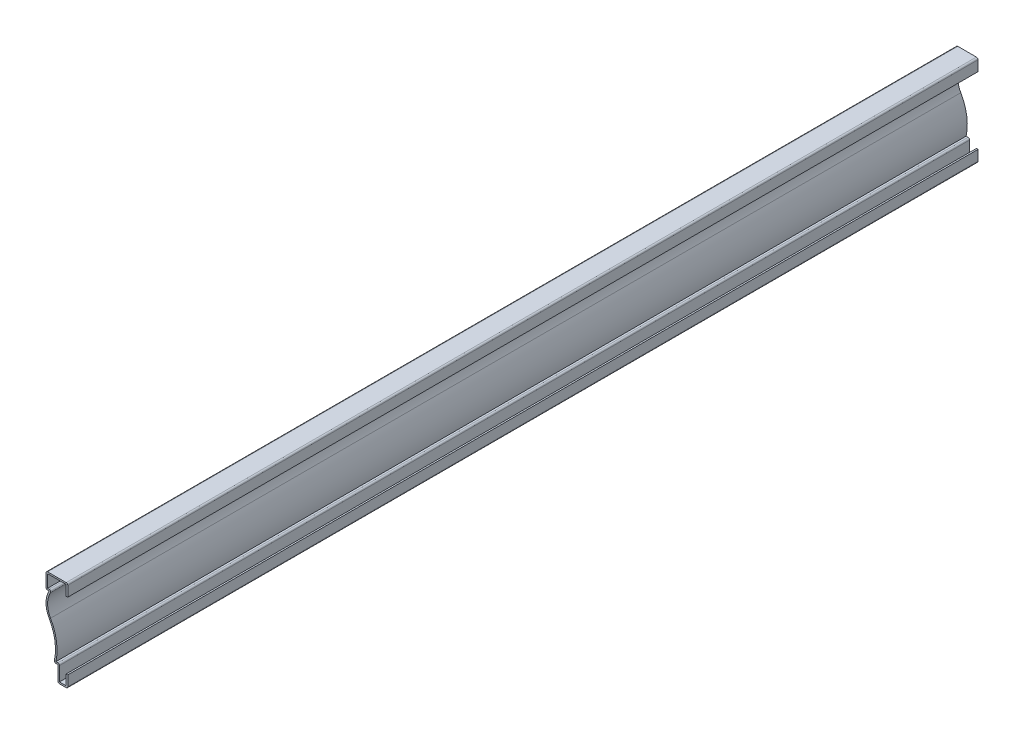
ISO-10303-21;
HEADER;
FILE_DESCRIPTION(('STEP AP214'),'2;1');
FILE_NAME('part.step','',(''),(''),'','','');
FILE_SCHEMA(('AUTOMOTIVE_DESIGN { 1 0 10303 214 1 1 1 1 }'));
ENDSEC;
DATA;
#1=APPLICATION_CONTEXT('core data for automotive mechanical design processes');
#2=APPLICATION_PROTOCOL_DEFINITION('international standard','automotive_design',2000,#1);
#3=PRODUCT_CONTEXT('',#1,'mechanical');
#4=PRODUCT('Part','Part','',(#3));
#5=PRODUCT_RELATED_PRODUCT_CATEGORY('part','',(#4));
#6=PRODUCT_DEFINITION_FORMATION('','',#4);
#7=PRODUCT_DEFINITION_CONTEXT('part definition',#1,'design');
#8=PRODUCT_DEFINITION('design','',#6,#7);
#9=PRODUCT_DEFINITION_SHAPE('','',#8);
#10=(LENGTH_UNIT() NAMED_UNIT(*) SI_UNIT(.MILLI.,.METRE.));
#11=(NAMED_UNIT(*) PLANE_ANGLE_UNIT() SI_UNIT($,.RADIAN.));
#12=(NAMED_UNIT(*) SI_UNIT($,.STERADIAN.) SOLID_ANGLE_UNIT());
#13=UNCERTAINTY_MEASURE_WITH_UNIT(LENGTH_MEASURE(1.E-05),#10,'distance_accuracy_value','');
#14=(GEOMETRIC_REPRESENTATION_CONTEXT(3) GLOBAL_UNCERTAINTY_ASSIGNED_CONTEXT((#13)) GLOBAL_UNIT_ASSIGNED_CONTEXT((#10,
#11,#12)) REPRESENTATION_CONTEXT('',''));
#15=CARTESIAN_POINT('',(0.,0.,0.));
#16=DIRECTION('',(0.,0.,1.));
#17=DIRECTION('',(1.,0.,0.));
#18=AXIS2_PLACEMENT_3D('',#15,#16,#17);
#19=CARTESIAN_POINT('',(-1.27,73.025,-730.25));
#20=DIRECTION('',(-1.,0.,0.));
#21=DIRECTION('',(0.,-1.,0.));
#22=AXIS2_PLACEMENT_3D('',#19,#20,#21);
#23=PLANE('',#22);
#24=DIRECTION('',(0.,-1.,0.));
#25=VECTOR('',#24,1.);
#26=CARTESIAN_POINT('',(-1.27,73.025,0.));
#27=LINE('',#26,#25);
#28=CARTESIAN_POINT('',(-1.27,71.755,0.));
#29=VERTEX_POINT('',#28);
#30=CARTESIAN_POINT('',(-1.27,63.5,0.));
#31=VERTEX_POINT('',#30);
#32=EDGE_CURVE('E312',#29,#31,#27,.T.);
#33=ORIENTED_EDGE('',*,*,#32,.F.);
#34=DIRECTION('',(0.,0.,1.));
#35=VECTOR('',#34,1.);
#36=CARTESIAN_POINT('',(-1.27,71.755,-730.25));
#37=LINE('',#36,#35);
#38=CARTESIAN_POINT('',(-1.27,71.755,-730.25));
#39=VERTEX_POINT('',#38);
#40=EDGE_CURVE('E257',#39,#29,#37,.T.);
#41=ORIENTED_EDGE('',*,*,#40,.F.);
#42=DIRECTION('',(0.,-1.,0.));
#43=VECTOR('',#42,1.);
#44=CARTESIAN_POINT('',(-1.27,73.025,-730.25));
#45=LINE('',#44,#43);
#46=CARTESIAN_POINT('',(-1.27,63.5,-730.25));
#47=VERTEX_POINT('',#46);
#48=EDGE_CURVE('E239',#39,#47,#45,.T.);
#49=ORIENTED_EDGE('',*,*,#48,.T.);
#50=DIRECTION('',(0.,0.,1.));
#51=VECTOR('',#50,1.);
#52=CARTESIAN_POINT('',(-1.27,63.5,-730.25));
#53=LINE('',#52,#51);
#54=EDGE_CURVE('E247',#47,#31,#53,.T.);
#55=ORIENTED_EDGE('',*,*,#54,.T.);
#56=EDGE_LOOP('',(#33,#41,#49,#55));
#57=FACE_BOUND('',#56,.T.);
#58=ADVANCED_FACE('F35',(#57),#23,.T.);
#59=CARTESIAN_POINT('',(-17.4625,71.755,-730.25));
#60=DIRECTION('',(0.,-1.,0.));
#61=DIRECTION('',(1.,0.,0.));
#62=AXIS2_PLACEMENT_3D('',#59,#60,#61);
#63=PLANE('',#62);
#64=DIRECTION('',(1.,0.,0.));
#65=VECTOR('',#64,1.);
#66=CARTESIAN_POINT('',(-17.4625,71.755,0.));
#67=LINE('',#66,#65);
#68=CARTESIAN_POINT('',(-16.1925,71.755,0.));
#69=VERTEX_POINT('',#68);
#70=EDGE_CURVE('E258',#69,#29,#67,.T.);
#71=ORIENTED_EDGE('',*,*,#70,.F.);
#72=DIRECTION('',(0.,0.,1.));
#73=VECTOR('',#72,1.);
#74=CARTESIAN_POINT('',(-16.1925,71.755,-730.25));
#75=LINE('',#74,#73);
#76=CARTESIAN_POINT('',(-16.1925,71.755,-730.25));
#77=VERTEX_POINT('',#76);
#78=EDGE_CURVE('E365',#77,#69,#75,.T.);
#79=ORIENTED_EDGE('',*,*,#78,.F.);
#80=DIRECTION('',(1.,0.,0.));
#81=VECTOR('',#80,1.);
#82=CARTESIAN_POINT('',(-17.4625,71.755,-730.25));
#83=LINE('',#82,#81);
#84=EDGE_CURVE('E255',#77,#39,#83,.T.);
#85=ORIENTED_EDGE('',*,*,#84,.T.);
#86=ORIENTED_EDGE('',*,*,#40,.T.);
#87=EDGE_LOOP('',(#71,#79,#85,#86));
#88=FACE_BOUND('',#87,.T.);
#89=ADVANCED_FACE('F473',(#88),#63,.T.);
#90=CARTESIAN_POINT('',(-16.1925,60.325,-730.25));
#91=DIRECTION('',(1.,0.,0.));
#92=DIRECTION('',(0.,0.,-1.));
#93=AXIS2_PLACEMENT_3D('',#90,#91,#92);
#94=PLANE('',#93);
#95=DIRECTION('',(0.,1.,0.));
#96=VECTOR('',#95,1.);
#97=CARTESIAN_POINT('',(-16.1925,60.325,0.));
#98=LINE('',#97,#96);
#99=CARTESIAN_POINT('',(-16.1925,61.595,0.));
#100=VERTEX_POINT('',#99);
#101=EDGE_CURVE('E261',#100,#69,#98,.T.);
#102=ORIENTED_EDGE('',*,*,#101,.F.);
#103=DIRECTION('',(0.,0.,1.));
#104=VECTOR('',#103,1.);
#105=CARTESIAN_POINT('',(-16.1925,61.595,-730.25));
#106=LINE('',#105,#104);
#107=CARTESIAN_POINT('',(-16.1925,61.595,-730.25));
#108=VERTEX_POINT('',#107);
#109=EDGE_CURVE('E367',#108,#100,#106,.T.);
#110=ORIENTED_EDGE('',*,*,#109,.F.);
#111=DIRECTION('',(0.,1.,0.));
#112=VECTOR('',#111,1.);
#113=CARTESIAN_POINT('',(-16.1925,60.325,-730.25));
#114=LINE('',#113,#112);
#115=EDGE_CURVE('E308',#108,#77,#114,.T.);
#116=ORIENTED_EDGE('',*,*,#115,.T.);
#117=ORIENTED_EDGE('',*,*,#78,.T.);
#118=EDGE_LOOP('',(#102,#110,#116,#117));
#119=FACE_BOUND('',#118,.T.);
#120=ADVANCED_FACE('F479',(#119),#94,.T.);
#121=CARTESIAN_POINT('',(-14.9304230288237,61.595,-730.25));
#122=DIRECTION('',(0.,1.,0.));
#123=DIRECTION('',(-1.,0.,0.));
#124=AXIS2_PLACEMENT_3D('',#121,#122,#123);
#125=PLANE('',#124);
#126=DIRECTION('',(-1.,0.,0.));
#127=VECTOR('',#126,1.);
#128=CARTESIAN_POINT('',(-14.9304230288237,61.595,0.));
#129=LINE('',#128,#127);
#130=CARTESIAN_POINT('',(-14.9304230288237,61.595,0.));
#131=VERTEX_POINT('',#130);
#132=EDGE_CURVE('E359',#131,#100,#129,.T.);
#133=ORIENTED_EDGE('',*,*,#132,.F.);
#134=DIRECTION('',(0.,0.,1.));
#135=VECTOR('',#134,1.);
#136=CARTESIAN_POINT('',(-14.9304230288237,61.595,-730.25));
#137=LINE('',#136,#135);
#138=CARTESIAN_POINT('',(-14.9304230288237,61.595,-730.25));
#139=VERTEX_POINT('',#138);
#140=EDGE_CURVE('E454',#131,#139,#137,.F.);
#141=ORIENTED_EDGE('',*,*,#140,.T.);
#142=DIRECTION('',(-1.,0.,0.));
#143=VECTOR('',#142,1.);
#144=CARTESIAN_POINT('',(-14.9304230288237,61.595,-730.25));
#145=LINE('',#144,#143);
#146=EDGE_CURVE('E306',#139,#108,#145,.T.);
#147=ORIENTED_EDGE('',*,*,#146,.T.);
#148=ORIENTED_EDGE('',*,*,#109,.T.);
#149=EDGE_LOOP('',(#133,#141,#147,#148));
#150=FACE_BOUND('',#149,.T.);
#151=ADVANCED_FACE('F482',(#150),#125,.T.);
#152=CARTESIAN_POINT('',(1.5875,50.8349673965863,-730.25));
#153=DIRECTION('',(0.,0.,1.));
#154=DIRECTION('',(1.,0.,0.));
#155=AXIS2_PLACEMENT_3D('',#152,#153,#154);
#156=CYLINDRICAL_SURFACE('',#155,17.78);
#157=CARTESIAN_POINT('',(1.5875,50.8349673965863,-730.25));
#158=DIRECTION('',(0.,0.,1.));
#159=DIRECTION('',(1.,0.,0.));
#160=AXIS2_PLACEMENT_3D('',#157,#158,#159);
#161=CIRCLE('',#160,17.78);
#162=CARTESIAN_POINT('',(-13.8292281602355,41.9776036334002,-730.25));
#163=VERTEX_POINT('',#162);
#164=CARTESIAN_POINT('',(-13.8292281602355,59.6923311597724,-730.25));
#165=VERTEX_POINT('',#164);
#166=EDGE_CURVE('E303',#163,#165,#161,.F.);
#167=ORIENTED_EDGE('',*,*,#166,.T.);
#168=DIRECTION('',(0.,0.,1.));
#169=VECTOR('',#168,1.);
#170=CARTESIAN_POINT('',(-13.8292281602355,59.6923311597724,-730.25));
#171=LINE('',#170,#169);
#172=CARTESIAN_POINT('',(-13.8292281602355,59.6923311597724,0.));
#173=VERTEX_POINT('',#172);
#174=EDGE_CURVE('E451',#165,#173,#171,.T.);
#175=ORIENTED_EDGE('',*,*,#174,.T.);
#176=CARTESIAN_POINT('',(1.5875,50.8349673965863,0.));
#177=DIRECTION('',(0.,0.,1.));
#178=DIRECTION('',(1.,0.,0.));
#179=AXIS2_PLACEMENT_3D('',#176,#177,#178);
#180=CIRCLE('',#179,17.78);
#181=CARTESIAN_POINT('',(-13.8292281602355,41.9776036334002,0.));
#182=VERTEX_POINT('',#181);
#183=EDGE_CURVE('E356',#182,#173,#180,.F.);
#184=ORIENTED_EDGE('',*,*,#183,.F.);
#185=DIRECTION('',(0.,0.,1.));
#186=VECTOR('',#185,1.);
#187=CARTESIAN_POINT('',(-13.8292281602355,41.9776036334002,-730.25));
#188=LINE('',#187,#186);
#189=EDGE_CURVE('E370',#163,#182,#188,.T.);
#190=ORIENTED_EDGE('',*,*,#189,.F.);
#191=EDGE_LOOP('',(#167,#175,#184,#190));
#192=FACE_BOUND('',#191,.T.);
#193=ADVANCED_FACE('F490',(#192),#156,.F.);
#194=CARTESIAN_POINT('',(-47.9662690864712,22.3648695863452,-730.25));
#195=DIRECTION('',(0.,0.,1.));
#196=DIRECTION('',(1.,0.,0.));
#197=AXIS2_PLACEMENT_3D('',#194,#195,#196);
#198=CYLINDRICAL_SURFACE('',#197,39.37);
#199=CARTESIAN_POINT('',(-47.9662690864712,22.3648695863452,0.));
#200=DIRECTION('',(0.,0.,1.));
#201=DIRECTION('',(1.,0.,0.));
#202=AXIS2_PLACEMENT_3D('',#199,#200,#201);
#203=CIRCLE('',#202,39.37);
#204=CARTESIAN_POINT('',(-9.50170013492493,13.97,0.));
#205=VERTEX_POINT('',#204);
#206=EDGE_CURVE('E353',#205,#182,#203,.T.);
#207=ORIENTED_EDGE('',*,*,#206,.F.);
#208=DIRECTION('',(0.,0.,1.));
#209=VECTOR('',#208,1.);
#210=CARTESIAN_POINT('',(-9.50170013492493,13.97,-730.25));
#211=LINE('',#210,#209);
#212=CARTESIAN_POINT('',(-9.50170013492493,13.97,-730.25));
#213=VERTEX_POINT('',#212);
#214=EDGE_CURVE('E372',#213,#205,#211,.T.);
#215=ORIENTED_EDGE('',*,*,#214,.F.);
#216=CARTESIAN_POINT('',(-47.9662690864712,22.3648695863452,-730.25));
#217=DIRECTION('',(0.,0.,1.));
#218=DIRECTION('',(1.,0.,0.));
#219=AXIS2_PLACEMENT_3D('',#216,#217,#218);
#220=CIRCLE('',#219,39.37);
#221=EDGE_CURVE('E300',#213,#163,#220,.T.);
#222=ORIENTED_EDGE('',*,*,#221,.T.);
#223=ORIENTED_EDGE('',*,*,#189,.T.);
#224=EDGE_LOOP('',(#207,#215,#222,#223));
#225=FACE_BOUND('',#224,.T.);
#226=ADVANCED_FACE('F494',(#225),#198,.T.);
#227=CARTESIAN_POINT('',(-7.9375,13.97,-730.25));
#228=DIRECTION('',(0.,1.,0.));
#229=DIRECTION('',(-1.,0.,0.));
#230=AXIS2_PLACEMENT_3D('',#227,#228,#229);
#231=PLANE('',#230);
#232=DIRECTION('',(-1.,0.,0.));
#233=VECTOR('',#232,1.);
#234=CARTESIAN_POINT('',(-7.9375,13.97,0.));
#235=LINE('',#234,#233);
#236=CARTESIAN_POINT('',(-7.9375,13.97,0.));
#237=VERTEX_POINT('',#236);
#238=EDGE_CURVE('E351',#237,#205,#235,.T.);
#239=ORIENTED_EDGE('',*,*,#238,.F.);
#240=DIRECTION('',(0.,0.,1.));
#241=VECTOR('',#240,1.);
#242=CARTESIAN_POINT('',(-7.9375,13.97,-730.25));
#243=LINE('',#242,#241);
#244=CARTESIAN_POINT('',(-7.9375,13.97,-730.25));
#245=VERTEX_POINT('',#244);
#246=EDGE_CURVE('E447',#237,#245,#243,.F.);
#247=ORIENTED_EDGE('',*,*,#246,.T.);
#248=DIRECTION('',(-1.,0.,0.));
#249=VECTOR('',#248,1.);
#250=CARTESIAN_POINT('',(-7.9375,13.97,-730.25));
#251=LINE('',#250,#249);
#252=EDGE_CURVE('E298',#245,#213,#251,.T.);
#253=ORIENTED_EDGE('',*,*,#252,.T.);
#254=ORIENTED_EDGE('',*,*,#214,.T.);
#255=EDGE_LOOP('',(#239,#247,#253,#254));
#256=FACE_BOUND('',#255,.T.);
#257=ADVANCED_FACE('F763',(#256),#231,.T.);
#258=CARTESIAN_POINT('',(-6.6675,0.,-730.25));
#259=DIRECTION('',(1.,0.,0.));
#260=DIRECTION('',(0.,0.,-1.));
#261=AXIS2_PLACEMENT_3D('',#258,#259,#260);
#262=PLANE('',#261);
#263=DIRECTION('',(0.,1.,0.));
#264=VECTOR('',#263,1.);
#265=CARTESIAN_POINT('',(-6.6675,0.,-730.25));
#266=LINE('',#265,#264);
#267=CARTESIAN_POINT('',(-6.6675,1.27,-730.25));
#268=VERTEX_POINT('',#267);
#269=CARTESIAN_POINT('',(-6.6675,12.7,-730.25));
#270=VERTEX_POINT('',#269);
#271=EDGE_CURVE('E295',#268,#270,#266,.T.);
#272=ORIENTED_EDGE('',*,*,#271,.T.);
#273=DIRECTION('',(0.,0.,1.));
#274=VECTOR('',#273,1.);
#275=CARTESIAN_POINT('',(-6.6675,12.7,-730.25));
#276=LINE('',#275,#274);
#277=CARTESIAN_POINT('',(-6.6675,12.7,0.));
#278=VERTEX_POINT('',#277);
#279=EDGE_CURVE('E444',#270,#278,#276,.T.);
#280=ORIENTED_EDGE('',*,*,#279,.T.);
#281=DIRECTION('',(0.,1.,0.));
#282=VECTOR('',#281,1.);
#283=CARTESIAN_POINT('',(-6.6675,0.,0.));
#284=LINE('',#283,#282);
#285=CARTESIAN_POINT('',(-6.6675,1.27,0.));
#286=VERTEX_POINT('',#285);
#287=EDGE_CURVE('E348',#286,#278,#284,.T.);
#288=ORIENTED_EDGE('',*,*,#287,.F.);
#289=DIRECTION('',(0.,0.,1.));
#290=VECTOR('',#289,1.);
#291=CARTESIAN_POINT('',(-6.6675,1.27,-730.25));
#292=LINE('',#291,#290);
#293=EDGE_CURVE('E375',#268,#286,#292,.T.);
#294=ORIENTED_EDGE('',*,*,#293,.F.);
#295=EDGE_LOOP('',(#272,#280,#288,#294));
#296=FACE_BOUND('',#295,.T.);
#297=ADVANCED_FACE('F506',(#296),#262,.T.);
#298=CARTESIAN_POINT('',(0.,1.27,-730.25));
#299=DIRECTION('',(0.,1.,0.));
#300=DIRECTION('',(-1.,0.,0.));
#301=AXIS2_PLACEMENT_3D('',#298,#299,#300);
#302=PLANE('',#301);
#303=DIRECTION('',(-1.,0.,0.));
#304=VECTOR('',#303,1.);
#305=CARTESIAN_POINT('',(0.,1.27,0.));
#306=LINE('',#305,#304);
#307=CARTESIAN_POINT('',(-1.27,1.27,0.));
#308=VERTEX_POINT('',#307);
#309=EDGE_CURVE('E345',#308,#286,#306,.T.);
#310=ORIENTED_EDGE('',*,*,#309,.F.);
#311=DIRECTION('',(0.,0.,1.));
#312=VECTOR('',#311,1.);
#313=CARTESIAN_POINT('',(-1.27,1.27,-730.25));
#314=LINE('',#313,#312);
#315=CARTESIAN_POINT('',(-1.27,1.27,-730.25));
#316=VERTEX_POINT('',#315);
#317=EDGE_CURVE('E377',#316,#308,#314,.T.);
#318=ORIENTED_EDGE('',*,*,#317,.F.);
#319=DIRECTION('',(-1.,0.,0.));
#320=VECTOR('',#319,1.);
#321=CARTESIAN_POINT('',(0.,1.27,-730.25));
#322=LINE('',#321,#320);
#323=EDGE_CURVE('E292',#316,#268,#322,.T.);
#324=ORIENTED_EDGE('',*,*,#323,.T.);
#325=ORIENTED_EDGE('',*,*,#293,.T.);
#326=EDGE_LOOP('',(#310,#318,#324,#325));
#327=FACE_BOUND('',#326,.T.);
#328=ADVANCED_FACE('F512',(#327),#302,.T.);
#329=CARTESIAN_POINT('',(-1.27,9.525,-730.25));
#330=DIRECTION('',(-1.,0.,0.));
#331=DIRECTION('',(0.,-1.,0.));
#332=AXIS2_PLACEMENT_3D('',#329,#330,#331);
#333=PLANE('',#332);
#334=DIRECTION('',(0.,-1.,0.));
#335=VECTOR('',#334,1.);
#336=CARTESIAN_POINT('',(-1.27,9.525,0.));
#337=LINE('',#336,#335);
#338=CARTESIAN_POINT('',(-1.27,9.525,0.));
#339=VERTEX_POINT('',#338);
#340=EDGE_CURVE('E342',#339,#308,#337,.T.);
#341=ORIENTED_EDGE('',*,*,#340,.F.);
#342=DIRECTION('',(0.,0.,1.));
#343=VECTOR('',#342,1.);
#344=CARTESIAN_POINT('',(-1.27,9.525,-730.25));
#345=LINE('',#344,#343);
#346=CARTESIAN_POINT('',(-1.27,9.525,-730.25));
#347=VERTEX_POINT('',#346);
#348=EDGE_CURVE('E379',#347,#339,#345,.T.);
#349=ORIENTED_EDGE('',*,*,#348,.F.);
#350=DIRECTION('',(0.,-1.,0.));
#351=VECTOR('',#350,1.);
#352=CARTESIAN_POINT('',(-1.27,9.525,-730.25));
#353=LINE('',#352,#351);
#354=EDGE_CURVE('E289',#347,#316,#353,.T.);
#355=ORIENTED_EDGE('',*,*,#354,.T.);
#356=ORIENTED_EDGE('',*,*,#317,.T.);
#357=EDGE_LOOP('',(#341,#349,#355,#356));
#358=FACE_BOUND('',#357,.T.);
#359=ADVANCED_FACE('F516',(#358),#333,.T.);
#360=CARTESIAN_POINT('',(-1.27,9.525,-730.25));
#361=DIRECTION('',(0.,-1.,0.));
#362=DIRECTION('',(0.,0.,-1.));
#363=AXIS2_PLACEMENT_3D('',#360,#361,#362);
#364=PLANE('',#363);
#365=DIRECTION('',(1.,0.,0.));
#366=VECTOR('',#365,1.);
#367=CARTESIAN_POINT('',(-1.27,9.525,0.));
#368=LINE('',#367,#366);
#369=CARTESIAN_POINT('',(0.,9.525,0.));
#370=VERTEX_POINT('',#369);
#371=EDGE_CURVE('E340',#339,#370,#368,.T.);
#372=ORIENTED_EDGE('',*,*,#371,.T.);
#373=DIRECTION('',(0.,0.,1.));
#374=VECTOR('',#373,1.);
#375=CARTESIAN_POINT('',(0.,9.525,-730.25));
#376=LINE('',#375,#374);
#377=CARTESIAN_POINT('',(0.,9.525,-730.25));
#378=VERTEX_POINT('',#377);
#379=EDGE_CURVE('E381',#378,#370,#376,.T.);
#380=ORIENTED_EDGE('',*,*,#379,.F.);
#381=DIRECTION('',(1.,0.,0.));
#382=VECTOR('',#381,1.);
#383=CARTESIAN_POINT('',(-1.27,9.525,-730.25));
#384=LINE('',#383,#382);
#385=EDGE_CURVE('E287',#347,#378,#384,.T.);
#386=ORIENTED_EDGE('',*,*,#385,.F.);
#387=ORIENTED_EDGE('',*,*,#348,.T.);
#388=EDGE_LOOP('',(#372,#380,#386,#387));
#389=FACE_BOUND('',#388,.T.);
#390=ADVANCED_FACE('F520',(#389),#364,.F.);
#391=CARTESIAN_POINT('',(0.,9.525,-730.25));
#392=DIRECTION('',(-1.,0.,0.));
#393=DIRECTION('',(0.,-1.,0.));
#394=AXIS2_PLACEMENT_3D('',#391,#392,#393);
#395=PLANE('',#394);
#396=DIRECTION('',(0.,-1.,0.));
#397=VECTOR('',#396,1.);
#398=CARTESIAN_POINT('',(0.,9.525,0.));
#399=LINE('',#398,#397);
#400=CARTESIAN_POINT('',(0.,1.27,0.));
#401=VERTEX_POINT('',#400);
#402=EDGE_CURVE('E337',#370,#401,#399,.T.);
#403=ORIENTED_EDGE('',*,*,#402,.T.);
#404=DIRECTION('',(0.,0.,1.));
#405=VECTOR('',#404,1.);
#406=CARTESIAN_POINT('',(0.,1.27,-730.25));
#407=LINE('',#406,#405);
#408=CARTESIAN_POINT('',(0.,1.27,-730.25));
#409=VERTEX_POINT('',#408);
#410=EDGE_CURVE('E449',#401,#409,#407,.F.);
#411=ORIENTED_EDGE('',*,*,#410,.T.);
#412=DIRECTION('',(0.,-1.,0.));
#413=VECTOR('',#412,1.);
#414=CARTESIAN_POINT('',(0.,9.525,-730.25));
#415=LINE('',#414,#413);
#416=EDGE_CURVE('E284',#378,#409,#415,.T.);
#417=ORIENTED_EDGE('',*,*,#416,.F.);
#418=ORIENTED_EDGE('',*,*,#379,.T.);
#419=EDGE_LOOP('',(#403,#411,#417,#418));
#420=FACE_BOUND('',#419,.T.);
#421=ADVANCED_FACE('F727',(#420),#395,.F.);
#422=CARTESIAN_POINT('',(0.,0.,-730.25));
#423=DIRECTION('',(0.,1.,0.));
#424=DIRECTION('',(-1.,0.,0.));
#425=AXIS2_PLACEMENT_3D('',#422,#423,#424);
#426=PLANE('',#425);
#427=DIRECTION('',(-1.,0.,0.));
#428=VECTOR('',#427,1.);
#429=CARTESIAN_POINT('',(0.,0.,0.));
#430=LINE('',#429,#428);
#431=CARTESIAN_POINT('',(-1.27,0.,0.));
#432=VERTEX_POINT('',#431);
#433=CARTESIAN_POINT('',(-6.6675,0.,0.));
#434=VERTEX_POINT('',#433);
#435=EDGE_CURVE('E334',#432,#434,#430,.T.);
#436=ORIENTED_EDGE('',*,*,#435,.T.);
#437=DIRECTION('',(0.,0.,1.));
#438=VECTOR('',#437,1.);
#439=CARTESIAN_POINT('',(-6.6675,0.,-730.25));
#440=LINE('',#439,#438);
#441=CARTESIAN_POINT('',(-6.6675,0.,-730.25));
#442=VERTEX_POINT('',#441);
#443=EDGE_CURVE('E442',#434,#442,#440,.F.);
#444=ORIENTED_EDGE('',*,*,#443,.T.);
#445=DIRECTION('',(-1.,0.,0.));
#446=VECTOR('',#445,1.);
#447=CARTESIAN_POINT('',(0.,0.,-730.25));
#448=LINE('',#447,#446);
#449=CARTESIAN_POINT('',(-1.27,0.,-730.25));
#450=VERTEX_POINT('',#449);
#451=EDGE_CURVE('E281',#450,#442,#448,.T.);
#452=ORIENTED_EDGE('',*,*,#451,.F.);
#453=DIRECTION('',(0.,0.,1.));
#454=VECTOR('',#453,1.);
#455=CARTESIAN_POINT('',(-1.27,0.,-730.25));
#456=LINE('',#455,#454);
#457=EDGE_CURVE('E439',#450,#432,#456,.T.);
#458=ORIENTED_EDGE('',*,*,#457,.T.);
#459=EDGE_LOOP('',(#436,#444,#452,#458));
#460=FACE_BOUND('',#459,.T.);
#461=ADVANCED_FACE('F531',(#460),#426,.F.);
#462=CARTESIAN_POINT('',(-7.9375,0.,-730.25));
#463=DIRECTION('',(1.,0.,0.));
#464=DIRECTION('',(0.,0.,-1.));
#465=AXIS2_PLACEMENT_3D('',#462,#463,#464);
#466=PLANE('',#465);
#467=DIRECTION('',(0.,1.,0.));
#468=VECTOR('',#467,1.);
#469=CARTESIAN_POINT('',(-7.9375,0.,-730.25));
#470=LINE('',#469,#468);
#471=CARTESIAN_POINT('',(-7.9375,1.27,-730.25));
#472=VERTEX_POINT('',#471);
#473=CARTESIAN_POINT('',(-7.9375,12.7,-730.25));
#474=VERTEX_POINT('',#473);
#475=EDGE_CURVE('E279',#472,#474,#470,.T.);
#476=ORIENTED_EDGE('',*,*,#475,.F.);
#477=DIRECTION('',(0.,0.,1.));
#478=VECTOR('',#477,1.);
#479=CARTESIAN_POINT('',(-7.9375,1.27,-730.25));
#480=LINE('',#479,#478);
#481=CARTESIAN_POINT('',(-7.9375,1.27,0.));
#482=VERTEX_POINT('',#481);
#483=EDGE_CURVE('E436',#472,#482,#480,.T.);
#484=ORIENTED_EDGE('',*,*,#483,.T.);
#485=DIRECTION('',(0.,1.,0.));
#486=VECTOR('',#485,1.);
#487=CARTESIAN_POINT('',(-7.9375,0.,0.));
#488=LINE('',#487,#486);
#489=CARTESIAN_POINT('',(-7.9375,12.7,0.));
#490=VERTEX_POINT('',#489);
#491=EDGE_CURVE('E332',#482,#490,#488,.T.);
#492=ORIENTED_EDGE('',*,*,#491,.T.);
#493=DIRECTION('',(0.,0.,1.));
#494=VECTOR('',#493,1.);
#495=CARTESIAN_POINT('',(-7.9375,12.7,-730.25));
#496=LINE('',#495,#494);
#497=EDGE_CURVE('E384',#474,#490,#496,.T.);
#498=ORIENTED_EDGE('',*,*,#497,.F.);
#499=EDGE_LOOP('',(#476,#484,#492,#498));
#500=FACE_BOUND('',#499,.T.);
#501=ADVANCED_FACE('F542',(#500),#466,.F.);
#502=CARTESIAN_POINT('',(-7.9375,12.7,-730.25));
#503=DIRECTION('',(0.,1.,0.));
#504=DIRECTION('',(-1.,0.,0.));
#505=AXIS2_PLACEMENT_3D('',#502,#503,#504);
#506=PLANE('',#505);
#507=DIRECTION('',(-1.,0.,0.));
#508=VECTOR('',#507,1.);
#509=CARTESIAN_POINT('',(-7.9375,12.7,0.));
#510=LINE('',#509,#508);
#511=CARTESIAN_POINT('',(-9.50170013492493,12.7,0.));
#512=VERTEX_POINT('',#511);
#513=EDGE_CURVE('E329',#490,#512,#510,.T.);
#514=ORIENTED_EDGE('',*,*,#513,.T.);
#515=DIRECTION('',(0.,0.,1.));
#516=VECTOR('',#515,1.);
#517=CARTESIAN_POINT('',(-9.50170013492493,12.7,-730.25));
#518=LINE('',#517,#516);
#519=CARTESIAN_POINT('',(-9.50170013492493,12.7,-730.25));
#520=VERTEX_POINT('',#519);
#521=EDGE_CURVE('E434',#512,#520,#518,.F.);
#522=ORIENTED_EDGE('',*,*,#521,.T.);
#523=DIRECTION('',(-1.,0.,0.));
#524=VECTOR('',#523,1.);
#525=CARTESIAN_POINT('',(-7.9375,12.7,-730.25));
#526=LINE('',#525,#524);
#527=EDGE_CURVE('E276',#474,#520,#526,.T.);
#528=ORIENTED_EDGE('',*,*,#527,.F.);
#529=ORIENTED_EDGE('',*,*,#497,.T.);
#530=EDGE_LOOP('',(#514,#522,#528,#529));
#531=FACE_BOUND('',#530,.T.);
#532=ADVANCED_FACE('F705',(#531),#506,.F.);
#533=CARTESIAN_POINT('',(-47.9662690864712,22.3648695863452,-730.25));
#534=DIRECTION('',(0.,0.,1.));
#535=DIRECTION('',(1.,0.,0.));
#536=AXIS2_PLACEMENT_3D('',#533,#534,#535);
#537=CYLINDRICAL_SURFACE('',#536,38.1);
#538=CARTESIAN_POINT('',(-47.9662690864712,22.3648695863452,-730.25));
#539=DIRECTION('',(0.,0.,1.));
#540=DIRECTION('',(1.,0.,0.));
#541=AXIS2_PLACEMENT_3D('',#538,#539,#540);
#542=CIRCLE('',#541,38.1);
#543=CARTESIAN_POINT('',(-10.742492681749,14.2408022447208,-730.25));
#544=VERTEX_POINT('',#543);
#545=CARTESIAN_POINT('',(-14.9304230288237,41.3449347931726,-730.25));
#546=VERTEX_POINT('',#545);
#547=EDGE_CURVE('E274',#544,#546,#542,.T.);
#548=ORIENTED_EDGE('',*,*,#547,.F.);
#549=DIRECTION('',(0.,0.,1.));
#550=VECTOR('',#549,1.);
#551=CARTESIAN_POINT('',(-10.742492681749,14.2408022447208,-730.25));
#552=LINE('',#551,#550);
#553=CARTESIAN_POINT('',(-10.742492681749,14.2408022447208,0.));
#554=VERTEX_POINT('',#553);
#555=EDGE_CURVE('E431',#544,#554,#552,.T.);
#556=ORIENTED_EDGE('',*,*,#555,.T.);
#557=CARTESIAN_POINT('',(-47.9662690864712,22.3648695863452,0.));
#558=DIRECTION('',(0.,0.,1.));
#559=DIRECTION('',(1.,0.,0.));
#560=AXIS2_PLACEMENT_3D('',#557,#558,#559);
#561=CIRCLE('',#560,38.1);
#562=CARTESIAN_POINT('',(-14.9304230288237,41.3449347931726,0.));
#563=VERTEX_POINT('',#562);
#564=EDGE_CURVE('E327',#554,#563,#561,.T.);
#565=ORIENTED_EDGE('',*,*,#564,.T.);
#566=DIRECTION('',(0.,0.,1.));
#567=VECTOR('',#566,1.);
#568=CARTESIAN_POINT('',(-14.9304230288237,41.3449347931726,-730.25));
#569=LINE('',#568,#567);
#570=EDGE_CURVE('E387',#546,#563,#569,.T.);
#571=ORIENTED_EDGE('',*,*,#570,.F.);
#572=EDGE_LOOP('',(#548,#556,#565,#571));
#573=FACE_BOUND('',#572,.T.);
#574=ADVANCED_FACE('F554',(#573),#537,.F.);
#575=CARTESIAN_POINT('',(1.5875,50.8349673965863,-730.25));
#576=DIRECTION('',(0.,0.,1.));
#577=DIRECTION('',(1.,0.,0.));
#578=AXIS2_PLACEMENT_3D('',#575,#576,#577);
#579=CYLINDRICAL_SURFACE('',#578,19.05);
#580=CARTESIAN_POINT('',(1.5875,50.8349673965863,0.));
#581=DIRECTION('',(0.,0.,-1.));
#582=DIRECTION('',(-1.,0.,0.));
#583=AXIS2_PLACEMENT_3D('',#580,#581,#582);
#584=CIRCLE('',#583,19.05);
#585=CARTESIAN_POINT('',(-14.9304230288237,60.325,0.));
#586=VERTEX_POINT('',#585);
#587=EDGE_CURVE('E325',#563,#586,#584,.T.);
#588=ORIENTED_EDGE('',*,*,#587,.T.);
#589=DIRECTION('',(0.,0.,1.));
#590=VECTOR('',#589,1.);
#591=CARTESIAN_POINT('',(-14.9304230288237,60.325,-730.25));
#592=LINE('',#591,#590);
#593=CARTESIAN_POINT('',(-14.9304230288237,60.325,-730.25));
#594=VERTEX_POINT('',#593);
#595=EDGE_CURVE('E390',#594,#586,#592,.T.);
#596=ORIENTED_EDGE('',*,*,#595,.F.);
#597=CARTESIAN_POINT('',(1.5875,50.8349673965863,-730.25));
#598=DIRECTION('',(0.,0.,-1.));
#599=DIRECTION('',(-1.,0.,0.));
#600=AXIS2_PLACEMENT_3D('',#597,#598,#599);
#601=CIRCLE('',#600,19.05);
#602=EDGE_CURVE('E272',#546,#594,#601,.T.);
#603=ORIENTED_EDGE('',*,*,#602,.F.);
#604=ORIENTED_EDGE('',*,*,#570,.T.);
#605=EDGE_LOOP('',(#588,#596,#603,#604));
#606=FACE_BOUND('',#605,.T.);
#607=ADVANCED_FACE('F560',(#606),#579,.T.);
#608=CARTESIAN_POINT('',(-14.9304230288237,60.325,-730.25));
#609=DIRECTION('',(0.,1.,0.));
#610=DIRECTION('',(-1.,0.,0.));
#611=AXIS2_PLACEMENT_3D('',#608,#609,#610);
#612=PLANE('',#611);
#613=DIRECTION('',(-1.,0.,0.));
#614=VECTOR('',#613,1.);
#615=CARTESIAN_POINT('',(-14.9304230288237,60.325,0.));
#616=LINE('',#615,#614);
#617=CARTESIAN_POINT('',(-16.1925,60.325,0.));
#618=VERTEX_POINT('',#617);
#619=EDGE_CURVE('E322',#586,#618,#616,.T.);
#620=ORIENTED_EDGE('',*,*,#619,.T.);
#621=DIRECTION('',(0.,0.,1.));
#622=VECTOR('',#621,1.);
#623=CARTESIAN_POINT('',(-16.1925,60.325,-730.25));
#624=LINE('',#623,#622);
#625=CARTESIAN_POINT('',(-16.1925,60.325,-730.25));
#626=VERTEX_POINT('',#625);
#627=EDGE_CURVE('E414',#618,#626,#624,.F.);
#628=ORIENTED_EDGE('',*,*,#627,.T.);
#629=DIRECTION('',(-1.,0.,0.));
#630=VECTOR('',#629,1.);
#631=CARTESIAN_POINT('',(-14.9304230288237,60.325,-730.25));
#632=LINE('',#631,#630);
#633=EDGE_CURVE('E270',#594,#626,#632,.T.);
#634=ORIENTED_EDGE('',*,*,#633,.F.);
#635=ORIENTED_EDGE('',*,*,#595,.T.);
#636=EDGE_LOOP('',(#620,#628,#634,#635));
#637=FACE_BOUND('',#636,.T.);
#638=ADVANCED_FACE('F564',(#637),#612,.F.);
#639=CARTESIAN_POINT('',(-17.4625,60.325,-730.25));
#640=DIRECTION('',(1.,0.,0.));
#641=DIRECTION('',(0.,0.,-1.));
#642=AXIS2_PLACEMENT_3D('',#639,#640,#641);
#643=PLANE('',#642);
#644=DIRECTION('',(0.,1.,0.));
#645=VECTOR('',#644,1.);
#646=CARTESIAN_POINT('',(-17.4625,60.325,-730.25));
#647=LINE('',#646,#645);
#648=CARTESIAN_POINT('',(-17.4625,61.595,-730.25));
#649=VERTEX_POINT('',#648);
#650=CARTESIAN_POINT('',(-17.4625,71.755,-730.25));
#651=VERTEX_POINT('',#650);
#652=EDGE_CURVE('E267',#649,#651,#647,.T.);
#653=ORIENTED_EDGE('',*,*,#652,.F.);
#654=DIRECTION('',(0.,0.,1.));
#655=VECTOR('',#654,1.);
#656=CARTESIAN_POINT('',(-17.4625,61.595,-730.25));
#657=LINE('',#656,#655);
#658=CARTESIAN_POINT('',(-17.4625,61.595,0.));
#659=VERTEX_POINT('',#658);
#660=EDGE_CURVE('E395',#649,#659,#657,.T.);
#661=ORIENTED_EDGE('',*,*,#660,.T.);
#662=DIRECTION('',(0.,1.,0.));
#663=VECTOR('',#662,1.);
#664=CARTESIAN_POINT('',(-17.4625,60.325,0.));
#665=LINE('',#664,#663);
#666=CARTESIAN_POINT('',(-17.4625,71.755,0.));
#667=VERTEX_POINT('',#666);
#668=EDGE_CURVE('E319',#659,#667,#665,.T.);
#669=ORIENTED_EDGE('',*,*,#668,.T.);
#670=DIRECTION('',(0.,0.,1.));
#671=VECTOR('',#670,1.);
#672=CARTESIAN_POINT('',(-17.4625,71.755,-730.25));
#673=LINE('',#672,#671);
#674=EDGE_CURVE('E364',#667,#651,#673,.F.);
#675=ORIENTED_EDGE('',*,*,#674,.T.);
#676=EDGE_LOOP('',(#653,#661,#669,#675));
#677=FACE_BOUND('',#676,.T.);
#678=ADVANCED_FACE('F572',(#677),#643,.F.);
#679=CARTESIAN_POINT('',(-17.4625,73.025,-730.25));
#680=DIRECTION('',(0.,-1.,0.));
#681=DIRECTION('',(1.,0.,0.));
#682=AXIS2_PLACEMENT_3D('',#679,#680,#681);
#683=PLANE('',#682);
#684=DIRECTION('',(1.,0.,0.));
#685=VECTOR('',#684,1.);
#686=CARTESIAN_POINT('',(-17.4625,73.025,-730.25));
#687=LINE('',#686,#685);
#688=CARTESIAN_POINT('',(-16.1925,73.025,-730.25));
#689=VERTEX_POINT('',#688);
#690=CARTESIAN_POINT('',(-1.27,73.025,-730.25));
#691=VERTEX_POINT('',#690);
#692=EDGE_CURVE('E265',#689,#691,#687,.T.);
#693=ORIENTED_EDGE('',*,*,#692,.F.);
#694=DIRECTION('',(0.,0.,1.));
#695=VECTOR('',#694,1.);
#696=CARTESIAN_POINT('',(-16.1925,73.025,-730.25));
#697=LINE('',#696,#695);
#698=CARTESIAN_POINT('',(-16.1925,73.025,0.));
#699=VERTEX_POINT('',#698);
#700=EDGE_CURVE('E43',#689,#699,#697,.T.);
#701=ORIENTED_EDGE('',*,*,#700,.T.);
#702=DIRECTION('',(1.,0.,0.));
#703=VECTOR('',#702,1.);
#704=CARTESIAN_POINT('',(-17.4625,73.025,0.));
#705=LINE('',#704,#703);
#706=CARTESIAN_POINT('',(-1.27,73.025,0.));
#707=VERTEX_POINT('',#706);
#708=EDGE_CURVE('E317',#699,#707,#705,.T.);
#709=ORIENTED_EDGE('',*,*,#708,.T.);
#710=DIRECTION('',(0.,0.,1.));
#711=VECTOR('',#710,1.);
#712=CARTESIAN_POINT('',(-1.27,73.025,-730.25));
#713=LINE('',#712,#711);
#714=EDGE_CURVE('E58',#707,#691,#713,.F.);
#715=ORIENTED_EDGE('',*,*,#714,.T.);
#716=EDGE_LOOP('',(#693,#701,#709,#715));
#717=FACE_BOUND('',#716,.T.);
#718=ADVANCED_FACE('F459',(#717),#683,.F.);
#719=CARTESIAN_POINT('',(0.,73.025,-730.25));
#720=DIRECTION('',(-1.,0.,0.));
#721=DIRECTION('',(0.,-1.,0.));
#722=AXIS2_PLACEMENT_3D('',#719,#720,#721);
#723=PLANE('',#722);
#724=DIRECTION('',(0.,-1.,0.));
#725=VECTOR('',#724,1.);
#726=CARTESIAN_POINT('',(0.,73.025,-730.25));
#727=LINE('',#726,#725);
#728=CARTESIAN_POINT('',(0.,71.755,-730.25));
#729=VERTEX_POINT('',#728);
#730=CARTESIAN_POINT('',(0.,63.5,-730.25));
#731=VERTEX_POINT('',#730);
#732=EDGE_CURVE('E241',#729,#731,#727,.T.);
#733=ORIENTED_EDGE('',*,*,#732,.F.);
#734=DIRECTION('',(0.,0.,1.));
#735=VECTOR('',#734,1.);
#736=CARTESIAN_POINT('',(0.,71.755,-730.25));
#737=LINE('',#736,#735);
#738=CARTESIAN_POINT('',(0.,71.755,0.));
#739=VERTEX_POINT('',#738);
#740=EDGE_CURVE('E11',#729,#739,#737,.T.);
#741=ORIENTED_EDGE('',*,*,#740,.T.);
#742=DIRECTION('',(0.,-1.,0.));
#743=VECTOR('',#742,1.);
#744=CARTESIAN_POINT('',(0.,73.025,0.));
#745=LINE('',#744,#743);
#746=CARTESIAN_POINT('',(0.,63.5,0.));
#747=VERTEX_POINT('',#746);
#748=EDGE_CURVE('E315',#739,#747,#745,.T.);
#749=ORIENTED_EDGE('',*,*,#748,.T.);
#750=DIRECTION('',(0.,0.,1.));
#751=VECTOR('',#750,1.);
#752=CARTESIAN_POINT('',(0.,63.5,-730.25));
#753=LINE('',#752,#751);
#754=EDGE_CURVE('E254',#731,#747,#753,.T.);
#755=ORIENTED_EDGE('',*,*,#754,.F.);
#756=EDGE_LOOP('',(#733,#741,#749,#755));
#757=FACE_BOUND('',#756,.T.);
#758=ADVANCED_FACE('F469',(#757),#723,.F.);
#759=CARTESIAN_POINT('',(0.,63.5,-730.25));
#760=DIRECTION('',(0.,1.,0.));
#761=DIRECTION('',(0.,0.,1.));
#762=AXIS2_PLACEMENT_3D('',#759,#760,#761);
#763=PLANE('',#762);
#764=DIRECTION('',(-1.,0.,0.));
#765=VECTOR('',#764,1.);
#766=CARTESIAN_POINT('',(0.,63.5,0.));
#767=LINE('',#766,#765);
#768=EDGE_CURVE('E250',#747,#31,#767,.T.);
#769=ORIENTED_EDGE('',*,*,#768,.T.);
#770=ORIENTED_EDGE('',*,*,#54,.F.);
#771=DIRECTION('',(-1.,0.,0.));
#772=VECTOR('',#771,1.);
#773=CARTESIAN_POINT('',(0.,63.5,-730.25));
#774=LINE('',#773,#772);
#775=EDGE_CURVE('E233',#731,#47,#774,.T.);
#776=ORIENTED_EDGE('',*,*,#775,.F.);
#777=ORIENTED_EDGE('',*,*,#754,.T.);
#778=EDGE_LOOP('',(#769,#770,#776,#777));
#779=FACE_BOUND('',#778,.T.);
#780=ADVANCED_FACE('F248',(#779),#763,.F.);
#781=CARTESIAN_POINT('',(1.5875,50.8349673965863,-730.25));
#782=DIRECTION('',(0.,0.,-1.));
#783=DIRECTION('',(-1.,0.,0.));
#784=AXIS2_PLACEMENT_3D('',#781,#782,#783);
#785=PLANE('',#784);
#786=ORIENTED_EDGE('',*,*,#633,.T.);
#787=CARTESIAN_POINT('',(-16.1925,61.595,-730.25));
#788=DIRECTION('',(0.,0.,-1.));
#789=DIRECTION('',(-1.,0.,0.));
#790=AXIS2_PLACEMENT_3D('',#787,#788,#789);
#791=CIRCLE('',#790,1.27);
#792=EDGE_CURVE('E429',#626,#649,#791,.T.);
#793=ORIENTED_EDGE('',*,*,#792,.T.);
#794=ORIENTED_EDGE('',*,*,#652,.T.);
#795=CARTESIAN_POINT('',(-16.1925,71.755,-730.25));
#796=DIRECTION('',(0.,0.,-1.));
#797=DIRECTION('',(-1.,0.,0.));
#798=AXIS2_PLACEMENT_3D('',#795,#796,#797);
#799=CIRCLE('',#798,1.27);
#800=EDGE_CURVE('E417',#651,#689,#799,.T.);
#801=ORIENTED_EDGE('',*,*,#800,.T.);
#802=ORIENTED_EDGE('',*,*,#692,.T.);
#803=CARTESIAN_POINT('',(-1.27,71.755,-730.25));
#804=DIRECTION('',(0.,0.,-1.));
#805=DIRECTION('',(-1.,0.,0.));
#806=AXIS2_PLACEMENT_3D('',#803,#804,#805);
#807=CIRCLE('',#806,1.27);
#808=EDGE_CURVE('E50',#691,#729,#807,.T.);
#809=ORIENTED_EDGE('',*,*,#808,.T.);
#810=ORIENTED_EDGE('',*,*,#732,.T.);
#811=ORIENTED_EDGE('',*,*,#775,.T.);
#812=ORIENTED_EDGE('',*,*,#48,.F.);
#813=ORIENTED_EDGE('',*,*,#84,.F.);
#814=ORIENTED_EDGE('',*,*,#115,.F.);
#815=ORIENTED_EDGE('',*,*,#146,.F.);
#816=CARTESIAN_POINT('',(-14.9304230288237,60.325,-730.25));
#817=DIRECTION('',(0.,0.,-1.));
#818=DIRECTION('',(-1.,0.,0.));
#819=AXIS2_PLACEMENT_3D('',#816,#817,#818);
#820=CIRCLE('',#819,1.27);
#821=EDGE_CURVE('E419',#139,#165,#820,.T.);
#822=ORIENTED_EDGE('',*,*,#821,.T.);
#823=ORIENTED_EDGE('',*,*,#166,.F.);
#824=ORIENTED_EDGE('',*,*,#221,.F.);
#825=ORIENTED_EDGE('',*,*,#252,.F.);
#826=CARTESIAN_POINT('',(-7.9375,12.7,-730.25));
#827=DIRECTION('',(0.,0.,-1.));
#828=DIRECTION('',(-1.,0.,0.));
#829=AXIS2_PLACEMENT_3D('',#826,#827,#828);
#830=CIRCLE('',#829,1.27);
#831=EDGE_CURVE('E423',#245,#270,#830,.T.);
#832=ORIENTED_EDGE('',*,*,#831,.T.);
#833=ORIENTED_EDGE('',*,*,#271,.F.);
#834=ORIENTED_EDGE('',*,*,#323,.F.);
#835=ORIENTED_EDGE('',*,*,#354,.F.);
#836=ORIENTED_EDGE('',*,*,#385,.T.);
#837=ORIENTED_EDGE('',*,*,#416,.T.);
#838=CARTESIAN_POINT('',(-1.27,1.27,-730.25));
#839=DIRECTION('',(0.,0.,-1.));
#840=DIRECTION('',(-1.,0.,0.));
#841=AXIS2_PLACEMENT_3D('',#838,#839,#840);
#842=CIRCLE('',#841,1.27);
#843=EDGE_CURVE('E421',#409,#450,#842,.T.);
#844=ORIENTED_EDGE('',*,*,#843,.T.);
#845=ORIENTED_EDGE('',*,*,#451,.T.);
#846=CARTESIAN_POINT('',(-6.6675,1.27,-730.25));
#847=DIRECTION('',(0.,0.,-1.));
#848=DIRECTION('',(-1.,0.,0.));
#849=AXIS2_PLACEMENT_3D('',#846,#847,#848);
#850=CIRCLE('',#849,1.27);
#851=EDGE_CURVE('E425',#442,#472,#850,.T.);
#852=ORIENTED_EDGE('',*,*,#851,.T.);
#853=ORIENTED_EDGE('',*,*,#475,.T.);
#854=ORIENTED_EDGE('',*,*,#527,.T.);
#855=CARTESIAN_POINT('',(-9.50170013492493,13.97,-730.25));
#856=DIRECTION('',(0.,0.,-1.));
#857=DIRECTION('',(-1.,0.,0.));
#858=AXIS2_PLACEMENT_3D('',#855,#856,#857);
#859=CIRCLE('',#858,1.27);
#860=EDGE_CURVE('E427',#520,#544,#859,.T.);
#861=ORIENTED_EDGE('',*,*,#860,.T.);
#862=ORIENTED_EDGE('',*,*,#547,.T.);
#863=ORIENTED_EDGE('',*,*,#602,.T.);
#864=EDGE_LOOP('',(#786,#793,#794,#801,#802,#809,#810,#811,#812,#813,#814,#815,#822,#823,#824,
#825,#832,#833,#834,#835,#836,#837,#844,#845,#852,#853,#854,#861,#862,#863));
#865=FACE_BOUND('',#864,.T.);
#866=ADVANCED_FACE('F236',(#865),#785,.T.);
#867=CARTESIAN_POINT('',(1.5875,50.8349673965863,0.));
#868=DIRECTION('',(0.,0.,-1.));
#869=DIRECTION('',(-1.,0.,0.));
#870=AXIS2_PLACEMENT_3D('',#867,#868,#869);
#871=PLANE('',#870);
#872=ORIENTED_EDGE('',*,*,#668,.F.);
#873=CARTESIAN_POINT('',(-16.1925,61.595,0.));
#874=DIRECTION('',(0.,0.,-1.));
#875=DIRECTION('',(-1.,0.,0.));
#876=AXIS2_PLACEMENT_3D('',#873,#874,#875);
#877=CIRCLE('',#876,1.27);
#878=EDGE_CURVE('E412',#659,#618,#877,.F.);
#879=ORIENTED_EDGE('',*,*,#878,.T.);
#880=ORIENTED_EDGE('',*,*,#619,.F.);
#881=ORIENTED_EDGE('',*,*,#587,.F.);
#882=ORIENTED_EDGE('',*,*,#564,.F.);
#883=CARTESIAN_POINT('',(-9.50170013492493,13.97,0.));
#884=DIRECTION('',(0.,0.,-1.));
#885=DIRECTION('',(-1.,0.,0.));
#886=AXIS2_PLACEMENT_3D('',#883,#884,#885);
#887=CIRCLE('',#886,1.27);
#888=EDGE_CURVE('E410',#554,#512,#887,.F.);
#889=ORIENTED_EDGE('',*,*,#888,.T.);
#890=ORIENTED_EDGE('',*,*,#513,.F.);
#891=ORIENTED_EDGE('',*,*,#491,.F.);
#892=CARTESIAN_POINT('',(-6.6675,1.27,0.));
#893=DIRECTION('',(0.,0.,-1.));
#894=DIRECTION('',(-1.,0.,0.));
#895=AXIS2_PLACEMENT_3D('',#892,#893,#894);
#896=CIRCLE('',#895,1.27);
#897=EDGE_CURVE('E408',#482,#434,#896,.F.);
#898=ORIENTED_EDGE('',*,*,#897,.T.);
#899=ORIENTED_EDGE('',*,*,#435,.F.);
#900=CARTESIAN_POINT('',(-1.27,1.27,0.));
#901=DIRECTION('',(0.,0.,-1.));
#902=DIRECTION('',(-1.,0.,0.));
#903=AXIS2_PLACEMENT_3D('',#900,#901,#902);
#904=CIRCLE('',#903,1.27);
#905=EDGE_CURVE('E404',#432,#401,#904,.F.);
#906=ORIENTED_EDGE('',*,*,#905,.T.);
#907=ORIENTED_EDGE('',*,*,#402,.F.);
#908=ORIENTED_EDGE('',*,*,#371,.F.);
#909=ORIENTED_EDGE('',*,*,#340,.T.);
#910=ORIENTED_EDGE('',*,*,#309,.T.);
#911=ORIENTED_EDGE('',*,*,#287,.T.);
#912=CARTESIAN_POINT('',(-7.9375,12.7,0.));
#913=DIRECTION('',(0.,0.,-1.));
#914=DIRECTION('',(-1.,0.,0.));
#915=AXIS2_PLACEMENT_3D('',#912,#913,#914);
#916=CIRCLE('',#915,1.27);
#917=EDGE_CURVE('E406',#278,#237,#916,.F.);
#918=ORIENTED_EDGE('',*,*,#917,.T.);
#919=ORIENTED_EDGE('',*,*,#238,.T.);
#920=ORIENTED_EDGE('',*,*,#206,.T.);
#921=ORIENTED_EDGE('',*,*,#183,.T.);
#922=CARTESIAN_POINT('',(-14.9304230288237,60.325,0.));
#923=DIRECTION('',(0.,0.,-1.));
#924=DIRECTION('',(-1.,0.,0.));
#925=AXIS2_PLACEMENT_3D('',#922,#923,#924);
#926=CIRCLE('',#925,1.27);
#927=EDGE_CURVE('E402',#173,#131,#926,.F.);
#928=ORIENTED_EDGE('',*,*,#927,.T.);
#929=ORIENTED_EDGE('',*,*,#132,.T.);
#930=ORIENTED_EDGE('',*,*,#101,.T.);
#931=ORIENTED_EDGE('',*,*,#70,.T.);
#932=ORIENTED_EDGE('',*,*,#32,.T.);
#933=ORIENTED_EDGE('',*,*,#768,.F.);
#934=ORIENTED_EDGE('',*,*,#748,.F.);
#935=CARTESIAN_POINT('',(-1.27,71.755,0.));
#936=DIRECTION('',(0.,0.,-1.));
#937=DIRECTION('',(-1.,0.,0.));
#938=AXIS2_PLACEMENT_3D('',#935,#936,#937);
#939=CIRCLE('',#938,1.27);
#940=EDGE_CURVE('E398',#739,#707,#939,.F.);
#941=ORIENTED_EDGE('',*,*,#940,.T.);
#942=ORIENTED_EDGE('',*,*,#708,.F.);
#943=CARTESIAN_POINT('',(-16.1925,71.755,0.));
#944=DIRECTION('',(0.,0.,-1.));
#945=DIRECTION('',(-1.,0.,0.));
#946=AXIS2_PLACEMENT_3D('',#943,#944,#945);
#947=CIRCLE('',#946,1.27);
#948=EDGE_CURVE('E400',#699,#667,#947,.F.);
#949=ORIENTED_EDGE('',*,*,#948,.T.);
#950=EDGE_LOOP('',(#872,#879,#880,#881,#882,#889,#890,#891,#898,#899,#906,#907,#908,#909,#910,
#911,#918,#919,#920,#921,#928,#929,#930,#931,#932,#933,#934,#941,#942,#949));
#951=FACE_BOUND('',#950,.T.);
#952=ADVANCED_FACE('F464',(#951),#871,.F.);
#953=CARTESIAN_POINT('',(-16.1925,61.595,-730.25));
#954=DIRECTION('',(0.,0.,1.));
#955=DIRECTION('',(1.,0.,0.));
#956=AXIS2_PLACEMENT_3D('',#953,#954,#955);
#957=CYLINDRICAL_SURFACE('',#956,1.27);
#958=ORIENTED_EDGE('',*,*,#792,.F.);
#959=ORIENTED_EDGE('',*,*,#627,.F.);
#960=ORIENTED_EDGE('',*,*,#878,.F.);
#961=ORIENTED_EDGE('',*,*,#660,.F.);
#962=EDGE_LOOP('',(#958,#959,#960,#961));
#963=FACE_BOUND('',#962,.T.);
#964=ADVANCED_FACE('F570',(#963),#957,.T.);
#965=CARTESIAN_POINT('',(-9.50170013492493,13.97,-730.25));
#966=DIRECTION('',(0.,0.,1.));
#967=DIRECTION('',(1.,0.,0.));
#968=AXIS2_PLACEMENT_3D('',#965,#966,#967);
#969=CYLINDRICAL_SURFACE('',#968,1.27);
#970=ORIENTED_EDGE('',*,*,#860,.F.);
#971=ORIENTED_EDGE('',*,*,#521,.F.);
#972=ORIENTED_EDGE('',*,*,#888,.F.);
#973=ORIENTED_EDGE('',*,*,#555,.F.);
#974=EDGE_LOOP('',(#970,#971,#972,#973));
#975=FACE_BOUND('',#974,.T.);
#976=ADVANCED_FACE('F551',(#975),#969,.T.);
#977=CARTESIAN_POINT('',(-6.6675,1.27,-730.25));
#978=DIRECTION('',(0.,0.,1.));
#979=DIRECTION('',(1.,0.,0.));
#980=AXIS2_PLACEMENT_3D('',#977,#978,#979);
#981=CYLINDRICAL_SURFACE('',#980,1.27);
#982=ORIENTED_EDGE('',*,*,#851,.F.);
#983=ORIENTED_EDGE('',*,*,#443,.F.);
#984=ORIENTED_EDGE('',*,*,#897,.F.);
#985=ORIENTED_EDGE('',*,*,#483,.F.);
#986=EDGE_LOOP('',(#982,#983,#984,#985));
#987=FACE_BOUND('',#986,.T.);
#988=ADVANCED_FACE('F539',(#987),#981,.T.);
#989=CARTESIAN_POINT('',(-7.9375,12.7,-730.25));
#990=DIRECTION('',(0.,0.,1.));
#991=DIRECTION('',(1.,0.,0.));
#992=AXIS2_PLACEMENT_3D('',#989,#990,#991);
#993=CYLINDRICAL_SURFACE('',#992,1.27);
#994=ORIENTED_EDGE('',*,*,#831,.F.);
#995=ORIENTED_EDGE('',*,*,#246,.F.);
#996=ORIENTED_EDGE('',*,*,#917,.F.);
#997=ORIENTED_EDGE('',*,*,#279,.F.);
#998=EDGE_LOOP('',(#994,#995,#996,#997));
#999=FACE_BOUND('',#998,.T.);
#1000=ADVANCED_FACE('F503',(#999),#993,.T.);
#1001=CARTESIAN_POINT('',(-1.27,1.27,-730.25));
#1002=DIRECTION('',(0.,0.,1.));
#1003=DIRECTION('',(1.,0.,0.));
#1004=AXIS2_PLACEMENT_3D('',#1001,#1002,#1003);
#1005=CYLINDRICAL_SURFACE('',#1004,1.27);
#1006=ORIENTED_EDGE('',*,*,#843,.F.);
#1007=ORIENTED_EDGE('',*,*,#410,.F.);
#1008=ORIENTED_EDGE('',*,*,#905,.F.);
#1009=ORIENTED_EDGE('',*,*,#457,.F.);
#1010=EDGE_LOOP('',(#1006,#1007,#1008,#1009));
#1011=FACE_BOUND('',#1010,.T.);
#1012=ADVANCED_FACE('F528',(#1011),#1005,.T.);
#1013=CARTESIAN_POINT('',(-14.9304230288237,60.325,-730.25));
#1014=DIRECTION('',(0.,0.,1.));
#1015=DIRECTION('',(1.,0.,0.));
#1016=AXIS2_PLACEMENT_3D('',#1013,#1014,#1015);
#1017=CYLINDRICAL_SURFACE('',#1016,1.27);
#1018=ORIENTED_EDGE('',*,*,#821,.F.);
#1019=ORIENTED_EDGE('',*,*,#140,.F.);
#1020=ORIENTED_EDGE('',*,*,#927,.F.);
#1021=ORIENTED_EDGE('',*,*,#174,.F.);
#1022=EDGE_LOOP('',(#1018,#1019,#1020,#1021));
#1023=FACE_BOUND('',#1022,.T.);
#1024=ADVANCED_FACE('F485',(#1023),#1017,.T.);
#1025=CARTESIAN_POINT('',(-16.1925,71.755,-730.25));
#1026=DIRECTION('',(0.,0.,1.));
#1027=DIRECTION('',(1.,0.,0.));
#1028=AXIS2_PLACEMENT_3D('',#1025,#1026,#1027);
#1029=CYLINDRICAL_SURFACE('',#1028,1.27);
#1030=ORIENTED_EDGE('',*,*,#800,.F.);
#1031=ORIENTED_EDGE('',*,*,#674,.F.);
#1032=ORIENTED_EDGE('',*,*,#948,.F.);
#1033=ORIENTED_EDGE('',*,*,#700,.F.);
#1034=EDGE_LOOP('',(#1030,#1031,#1032,#1033));
#1035=FACE_BOUND('',#1034,.T.);
#1036=ADVANCED_FACE('F574',(#1035),#1029,.T.);
#1037=CARTESIAN_POINT('',(-1.27,71.755,-730.25));
#1038=DIRECTION('',(0.,0.,1.));
#1039=DIRECTION('',(1.,0.,0.));
#1040=AXIS2_PLACEMENT_3D('',#1037,#1038,#1039);
#1041=CYLINDRICAL_SURFACE('',#1040,1.27);
#1042=ORIENTED_EDGE('',*,*,#808,.F.);
#1043=ORIENTED_EDGE('',*,*,#714,.F.);
#1044=ORIENTED_EDGE('',*,*,#940,.F.);
#1045=ORIENTED_EDGE('',*,*,#740,.F.);
#1046=EDGE_LOOP('',(#1042,#1043,#1044,#1045));
#1047=FACE_BOUND('',#1046,.T.);
#1048=ADVANCED_FACE('F37',(#1047),#1041,.T.);
#1049=CLOSED_SHELL('',(#58,#89,#120,#151,#193,#226,#257,#297,#328,#359,#390,#421,#461,#501,#532,
#574,#607,#638,#678,#718,#758,#780,#866,#952,#964,#976,#988,#1000,#1012,#1024,#1036,#1048));
#1050=MANIFOLD_SOLID_BREP('B2',#1049);
#1051=ADVANCED_BREP_SHAPE_REPRESENTATION('',(#18,#1050),#14);
#1052=SHAPE_DEFINITION_REPRESENTATION(#9,#1051);
ENDSEC;
END-ISO-10303-21;
